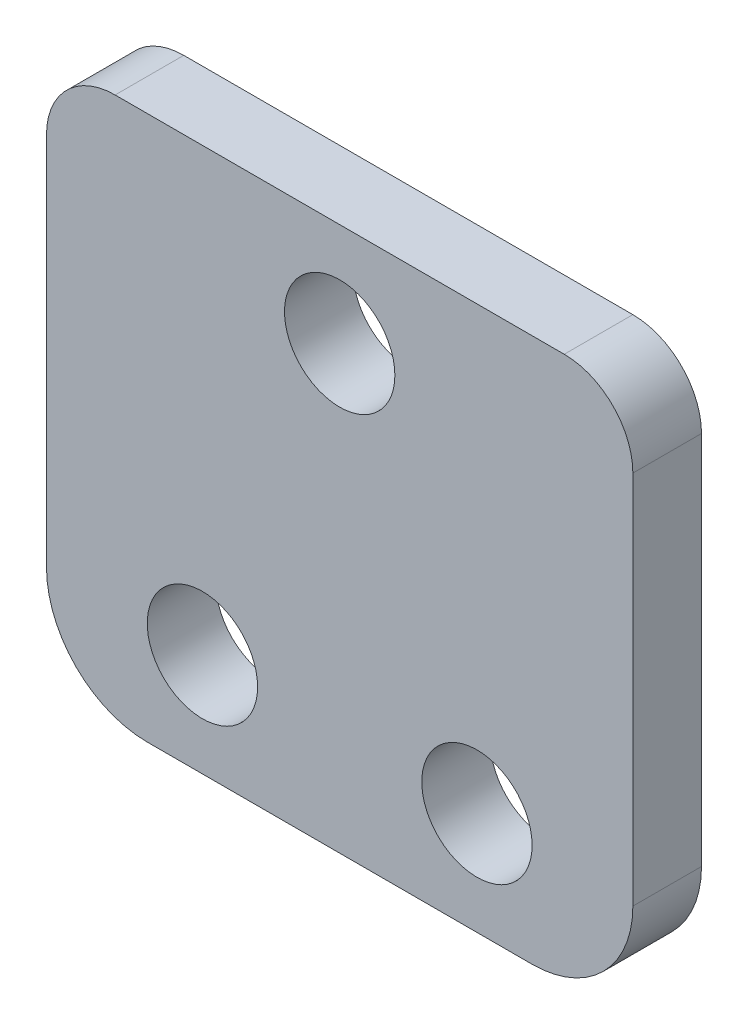
ISO-10303-21;
HEADER;
FILE_DESCRIPTION(('STEP AP214'),'2;1');
FILE_NAME('part.step','',(''),(''),'','','');
FILE_SCHEMA(('AUTOMOTIVE_DESIGN { 1 0 10303 214 1 1 1 1 }'));
ENDSEC;
DATA;
#1=APPLICATION_CONTEXT('core data for automotive mechanical design processes');
#2=APPLICATION_PROTOCOL_DEFINITION('international standard','automotive_design',2000,#1);
#3=PRODUCT_CONTEXT('',#1,'mechanical');
#4=PRODUCT('Part','Part','',(#3));
#5=PRODUCT_RELATED_PRODUCT_CATEGORY('part','',(#4));
#6=PRODUCT_DEFINITION_FORMATION('','',#4);
#7=PRODUCT_DEFINITION_CONTEXT('part definition',#1,'design');
#8=PRODUCT_DEFINITION('design','',#6,#7);
#9=PRODUCT_DEFINITION_SHAPE('','',#8);
#10=(LENGTH_UNIT() NAMED_UNIT(*) SI_UNIT(.MILLI.,.METRE.));
#11=(NAMED_UNIT(*) PLANE_ANGLE_UNIT() SI_UNIT($,.RADIAN.));
#12=(NAMED_UNIT(*) SI_UNIT($,.STERADIAN.) SOLID_ANGLE_UNIT());
#13=UNCERTAINTY_MEASURE_WITH_UNIT(LENGTH_MEASURE(1.E-05),#10,'distance_accuracy_value','');
#14=(GEOMETRIC_REPRESENTATION_CONTEXT(3) GLOBAL_UNCERTAINTY_ASSIGNED_CONTEXT((#13)) GLOBAL_UNIT_ASSIGNED_CONTEXT((#10,
#11,#12)) REPRESENTATION_CONTEXT('',''));
#15=CARTESIAN_POINT('',(0.,0.,0.));
#16=DIRECTION('',(0.,0.,1.));
#17=DIRECTION('',(1.,0.,0.));
#18=AXIS2_PLACEMENT_3D('',#15,#16,#17);
#19=CARTESIAN_POINT('',(-13.5636000000001,0.,3.175));
#20=DIRECTION('',(-1.,0.,0.));
#21=DIRECTION('',(0.,-1.,0.));
#22=AXIS2_PLACEMENT_3D('',#19,#20,#21);
#23=PLANE('',#22);
#24=DIRECTION('',(0.,1.,0.));
#25=VECTOR('',#24,1.);
#26=CARTESIAN_POINT('',(-13.5636000000001,0.,0.));
#27=LINE('',#26,#25);
#28=CARTESIAN_POINT('',(-13.5636000000001,0.,0.));
#29=VERTEX_POINT('',#28);
#30=CARTESIAN_POINT('',(-13.5636000000001,17.3481999999997,0.));
#31=VERTEX_POINT('',#30);
#32=EDGE_CURVE('E128',#29,#31,#27,.T.);
#33=ORIENTED_EDGE('',*,*,#32,.F.);
#34=DIRECTION('',(0.,0.,-1.));
#35=VECTOR('',#34,1.);
#36=CARTESIAN_POINT('',(-13.5636000000001,0.,3.175));
#37=LINE('',#36,#35);
#38=CARTESIAN_POINT('',(-13.5636000000001,0.,3.175));
#39=VERTEX_POINT('',#38);
#40=EDGE_CURVE('E11',#39,#29,#37,.T.);
#41=ORIENTED_EDGE('',*,*,#40,.F.);
#42=DIRECTION('',(0.,1.,0.));
#43=VECTOR('',#42,1.);
#44=CARTESIAN_POINT('',(-13.5636000000001,0.,3.175));
#45=LINE('',#44,#43);
#46=CARTESIAN_POINT('',(-13.5636000000001,17.3481999999997,3.175));
#47=VERTEX_POINT('',#46);
#48=EDGE_CURVE('E146',#39,#47,#45,.T.);
#49=ORIENTED_EDGE('',*,*,#48,.T.);
#50=DIRECTION('',(0.,0.,-1.));
#51=VECTOR('',#50,1.);
#52=CARTESIAN_POINT('',(-13.5636000000001,17.3481999999997,3.175));
#53=LINE('',#52,#51);
#54=EDGE_CURVE('E86',#47,#31,#53,.T.);
#55=ORIENTED_EDGE('',*,*,#54,.T.);
#56=EDGE_LOOP('',(#33,#41,#49,#55));
#57=FACE_BOUND('',#56,.T.);
#58=ADVANCED_FACE('F35',(#57),#23,.T.);
#59=CARTESIAN_POINT('',(-8.90270000000005,0.,3.175));
#60=DIRECTION('',(0.,0.,-1.));
#61=DIRECTION('',(-1.,0.,0.));
#62=AXIS2_PLACEMENT_3D('',#59,#60,#61);
#63=CYLINDRICAL_SURFACE('',#62,4.6609);
#64=CARTESIAN_POINT('',(-8.90270000000005,0.,0.));
#65=DIRECTION('',(0.,0.,1.));
#66=DIRECTION('',(1.,0.,0.));
#67=AXIS2_PLACEMENT_3D('',#64,#65,#66);
#68=CIRCLE('',#67,4.6609);
#69=CARTESIAN_POINT('',(-8.90270000000005,-4.6609,0.));
#70=VERTEX_POINT('',#69);
#71=EDGE_CURVE('E131',#29,#70,#68,.T.);
#72=ORIENTED_EDGE('',*,*,#71,.T.);
#73=DIRECTION('',(0.,0.,-1.));
#74=VECTOR('',#73,1.);
#75=CARTESIAN_POINT('',(-8.90270000000005,-4.6609,3.175));
#76=LINE('',#75,#74);
#77=CARTESIAN_POINT('',(-8.90270000000005,-4.6609,3.175));
#78=VERTEX_POINT('',#77);
#79=EDGE_CURVE('E43',#78,#70,#76,.T.);
#80=ORIENTED_EDGE('',*,*,#79,.F.);
#81=CARTESIAN_POINT('',(-8.90270000000005,0.,3.175));
#82=DIRECTION('',(0.,0.,1.));
#83=DIRECTION('',(1.,0.,0.));
#84=AXIS2_PLACEMENT_3D('',#81,#82,#83);
#85=CIRCLE('',#84,4.6609);
#86=EDGE_CURVE('E178',#39,#78,#85,.T.);
#87=ORIENTED_EDGE('',*,*,#86,.F.);
#88=ORIENTED_EDGE('',*,*,#40,.T.);
#89=EDGE_LOOP('',(#72,#80,#87,#88));
#90=FACE_BOUND('',#89,.T.);
#91=ADVANCED_FACE('F163',(#90),#63,.T.);
#92=CARTESIAN_POINT('',(0.,-4.6609,3.175));
#93=DIRECTION('',(0.,-1.,0.));
#94=DIRECTION('',(1.,0.,0.));
#95=AXIS2_PLACEMENT_3D('',#92,#93,#94);
#96=PLANE('',#95);
#97=DIRECTION('',(-1.,0.,0.));
#98=VECTOR('',#97,1.);
#99=CARTESIAN_POINT('',(0.,-4.6609,0.));
#100=LINE('',#99,#98);
#101=CARTESIAN_POINT('',(8.9027,-4.6609,0.));
#102=VERTEX_POINT('',#101);
#103=EDGE_CURVE('E135',#102,#70,#100,.T.);
#104=ORIENTED_EDGE('',*,*,#103,.F.);
#105=DIRECTION('',(0.,0.,-1.));
#106=VECTOR('',#105,1.);
#107=CARTESIAN_POINT('',(8.9027,-4.6609,3.175));
#108=LINE('',#107,#106);
#109=CARTESIAN_POINT('',(8.9027,-4.6609,3.175));
#110=VERTEX_POINT('',#109);
#111=EDGE_CURVE('E153',#110,#102,#108,.T.);
#112=ORIENTED_EDGE('',*,*,#111,.F.);
#113=DIRECTION('',(-1.,0.,0.));
#114=VECTOR('',#113,1.);
#115=CARTESIAN_POINT('',(0.,-4.6609,3.175));
#116=LINE('',#115,#114);
#117=EDGE_CURVE('E160',#110,#78,#116,.T.);
#118=ORIENTED_EDGE('',*,*,#117,.T.);
#119=ORIENTED_EDGE('',*,*,#79,.T.);
#120=EDGE_LOOP('',(#104,#112,#118,#119));
#121=FACE_BOUND('',#120,.T.);
#122=ADVANCED_FACE('F158',(#121),#96,.T.);
#123=CARTESIAN_POINT('',(8.9027,0.,3.175));
#124=DIRECTION('',(0.,0.,-1.));
#125=DIRECTION('',(-1.,0.,0.));
#126=AXIS2_PLACEMENT_3D('',#123,#124,#125);
#127=CYLINDRICAL_SURFACE('',#126,4.6609);
#128=CARTESIAN_POINT('',(8.9027,0.,0.));
#129=DIRECTION('',(0.,0.,1.));
#130=DIRECTION('',(1.,0.,0.));
#131=AXIS2_PLACEMENT_3D('',#128,#129,#130);
#132=CIRCLE('',#131,4.6609);
#133=CARTESIAN_POINT('',(13.5636,0.,0.));
#134=VERTEX_POINT('',#133);
#135=EDGE_CURVE('E138',#102,#134,#132,.T.);
#136=ORIENTED_EDGE('',*,*,#135,.T.);
#137=DIRECTION('',(0.,0.,-1.));
#138=VECTOR('',#137,1.);
#139=CARTESIAN_POINT('',(13.5636,0.,3.175));
#140=LINE('',#139,#138);
#141=CARTESIAN_POINT('',(13.5636,0.,3.175));
#142=VERTEX_POINT('',#141);
#143=EDGE_CURVE('E150',#142,#134,#140,.T.);
#144=ORIENTED_EDGE('',*,*,#143,.F.);
#145=CARTESIAN_POINT('',(8.9027,0.,3.175));
#146=DIRECTION('',(0.,0.,1.));
#147=DIRECTION('',(1.,0.,0.));
#148=AXIS2_PLACEMENT_3D('',#145,#146,#147);
#149=CIRCLE('',#148,4.6609);
#150=EDGE_CURVE('E174',#110,#142,#149,.T.);
#151=ORIENTED_EDGE('',*,*,#150,.F.);
#152=ORIENTED_EDGE('',*,*,#111,.T.);
#153=EDGE_LOOP('',(#136,#144,#151,#152));
#154=FACE_BOUND('',#153,.T.);
#155=ADVANCED_FACE('F170',(#154),#127,.T.);
#156=CARTESIAN_POINT('',(13.5636,0.,3.175));
#157=DIRECTION('',(-1.,0.,0.));
#158=DIRECTION('',(0.,0.,1.));
#159=AXIS2_PLACEMENT_3D('',#156,#157,#158);
#160=PLANE('',#159);
#161=DIRECTION('',(0.,1.,0.));
#162=VECTOR('',#161,1.);
#163=CARTESIAN_POINT('',(13.5636,0.,0.));
#164=LINE('',#163,#162);
#165=CARTESIAN_POINT('',(13.5636,17.3481999999997,0.));
#166=VERTEX_POINT('',#165);
#167=EDGE_CURVE('E140',#134,#166,#164,.T.);
#168=ORIENTED_EDGE('',*,*,#167,.T.);
#169=DIRECTION('',(0.,0.,-1.));
#170=VECTOR('',#169,1.);
#171=CARTESIAN_POINT('',(13.5636,17.3481999999997,3.175));
#172=LINE('',#171,#170);
#173=CARTESIAN_POINT('',(13.5636,17.3481999999997,3.175));
#174=VERTEX_POINT('',#173);
#175=EDGE_CURVE('E120',#174,#166,#172,.T.);
#176=ORIENTED_EDGE('',*,*,#175,.F.);
#177=DIRECTION('',(0.,1.,0.));
#178=VECTOR('',#177,1.);
#179=CARTESIAN_POINT('',(13.5636,0.,3.175));
#180=LINE('',#179,#178);
#181=EDGE_CURVE('E111',#142,#174,#180,.T.);
#182=ORIENTED_EDGE('',*,*,#181,.F.);
#183=ORIENTED_EDGE('',*,*,#143,.T.);
#184=EDGE_LOOP('',(#168,#176,#182,#183));
#185=FACE_BOUND('',#184,.T.);
#186=ADVANCED_FACE('F173',(#185),#160,.F.);
#187=CARTESIAN_POINT('',(10.3886,17.3481999999997,3.175));
#188=DIRECTION('',(0.,0.,-1.));
#189=DIRECTION('',(-1.,0.,0.));
#190=AXIS2_PLACEMENT_3D('',#187,#188,#189);
#191=CYLINDRICAL_SURFACE('',#190,3.175);
#192=CARTESIAN_POINT('',(10.3886,17.3481999999997,0.));
#193=DIRECTION('',(0.,0.,1.));
#194=DIRECTION('',(1.,0.,0.));
#195=AXIS2_PLACEMENT_3D('',#192,#193,#194);
#196=CIRCLE('',#195,3.175);
#197=CARTESIAN_POINT('',(10.3886,20.5231999999997,0.));
#198=VERTEX_POINT('',#197);
#199=EDGE_CURVE('E119',#166,#198,#196,.T.);
#200=ORIENTED_EDGE('',*,*,#199,.T.);
#201=DIRECTION('',(0.,0.,-1.));
#202=VECTOR('',#201,1.);
#203=CARTESIAN_POINT('',(10.3886,20.5231999999997,3.175));
#204=LINE('',#203,#202);
#205=CARTESIAN_POINT('',(10.3886,20.5231999999997,3.175));
#206=VERTEX_POINT('',#205);
#207=EDGE_CURVE('E116',#206,#198,#204,.T.);
#208=ORIENTED_EDGE('',*,*,#207,.F.);
#209=CARTESIAN_POINT('',(10.3886,17.3481999999997,3.175));
#210=DIRECTION('',(0.,0.,1.));
#211=DIRECTION('',(1.,0.,0.));
#212=AXIS2_PLACEMENT_3D('',#209,#210,#211);
#213=CIRCLE('',#212,3.175);
#214=EDGE_CURVE('E105',#174,#206,#213,.T.);
#215=ORIENTED_EDGE('',*,*,#214,.F.);
#216=ORIENTED_EDGE('',*,*,#175,.T.);
#217=EDGE_LOOP('',(#200,#208,#215,#216));
#218=FACE_BOUND('',#217,.T.);
#219=ADVANCED_FACE('F117',(#218),#191,.T.);
#220=CARTESIAN_POINT('',(0.,20.5231999999997,3.175));
#221=DIRECTION('',(0.,-1.,0.));
#222=DIRECTION('',(1.,0.,0.));
#223=AXIS2_PLACEMENT_3D('',#220,#221,#222);
#224=PLANE('',#223);
#225=DIRECTION('',(-1.,0.,0.));
#226=VECTOR('',#225,1.);
#227=CARTESIAN_POINT('',(0.,20.5231999999997,0.));
#228=LINE('',#227,#226);
#229=CARTESIAN_POINT('',(-10.3886000000001,20.5231999999997,0.));
#230=VERTEX_POINT('',#229);
#231=EDGE_CURVE('E79',#198,#230,#228,.T.);
#232=ORIENTED_EDGE('',*,*,#231,.T.);
#233=DIRECTION('',(0.,0.,-1.));
#234=VECTOR('',#233,1.);
#235=CARTESIAN_POINT('',(-10.3886000000001,20.5231999999997,3.175));
#236=LINE('',#235,#234);
#237=CARTESIAN_POINT('',(-10.3886000000001,20.5231999999997,3.175));
#238=VERTEX_POINT('',#237);
#239=EDGE_CURVE('E121',#238,#230,#236,.T.);
#240=ORIENTED_EDGE('',*,*,#239,.F.);
#241=DIRECTION('',(-1.,0.,0.));
#242=VECTOR('',#241,1.);
#243=CARTESIAN_POINT('',(0.,20.5231999999997,3.175));
#244=LINE('',#243,#242);
#245=EDGE_CURVE('E109',#206,#238,#244,.T.);
#246=ORIENTED_EDGE('',*,*,#245,.F.);
#247=ORIENTED_EDGE('',*,*,#207,.T.);
#248=EDGE_LOOP('',(#232,#240,#246,#247));
#249=FACE_BOUND('',#248,.T.);
#250=ADVANCED_FACE('F123',(#249),#224,.F.);
#251=CARTESIAN_POINT('',(-10.3886000000001,17.3481999999997,3.175));
#252=DIRECTION('',(0.,0.,-1.));
#253=DIRECTION('',(-1.,0.,0.));
#254=AXIS2_PLACEMENT_3D('',#251,#252,#253);
#255=CYLINDRICAL_SURFACE('',#254,3.175);
#256=CARTESIAN_POINT('',(-10.3886000000001,17.3481999999997,0.));
#257=DIRECTION('',(0.,0.,1.));
#258=DIRECTION('',(1.,0.,0.));
#259=AXIS2_PLACEMENT_3D('',#256,#257,#258);
#260=CIRCLE('',#259,3.175);
#261=EDGE_CURVE('E144',#230,#31,#260,.T.);
#262=ORIENTED_EDGE('',*,*,#261,.T.);
#263=ORIENTED_EDGE('',*,*,#54,.F.);
#264=CARTESIAN_POINT('',(-10.3886000000001,17.3481999999997,3.175));
#265=DIRECTION('',(0.,0.,1.));
#266=DIRECTION('',(1.,0.,0.));
#267=AXIS2_PLACEMENT_3D('',#264,#265,#266);
#268=CIRCLE('',#267,3.175);
#269=EDGE_CURVE('E51',#238,#47,#268,.T.);
#270=ORIENTED_EDGE('',*,*,#269,.F.);
#271=ORIENTED_EDGE('',*,*,#239,.T.);
#272=EDGE_LOOP('',(#262,#263,#270,#271));
#273=FACE_BOUND('',#272,.T.);
#274=ADVANCED_FACE('F203',(#273),#255,.T.);
#275=CARTESIAN_POINT('',(0.,0.,3.175));
#276=DIRECTION('',(0.,0.,1.));
#277=DIRECTION('',(1.,0.,0.));
#278=AXIS2_PLACEMENT_3D('',#275,#276,#277);
#279=PLANE('',#278);
#280=CARTESIAN_POINT('',(6.35,0.101600000000004,3.175));
#281=DIRECTION('',(0.,0.,1.));
#282=DIRECTION('',(1.,0.,0.));
#283=AXIS2_PLACEMENT_3D('',#280,#281,#282);
#284=CIRCLE('',#283,2.55269999999999);
#285=CARTESIAN_POINT('',(8.90269999999999,0.101600000000004,3.175));
#286=VERTEX_POINT('',#285);
#287=EDGE_CURVE('E195',#286,#286,#284,.T.);
#288=ORIENTED_EDGE('',*,*,#287,.F.);
#289=EDGE_LOOP('',(#288));
#290=FACE_BOUND('',#289,.T.);
#291=CARTESIAN_POINT('',(-6.35,0.101600000000004,3.175));
#292=DIRECTION('',(0.,0.,1.));
#293=DIRECTION('',(1.,0.,0.));
#294=AXIS2_PLACEMENT_3D('',#291,#292,#293);
#295=CIRCLE('',#294,2.55269999999999);
#296=CARTESIAN_POINT('',(-3.79730000000001,0.101600000000004,3.175));
#297=VERTEX_POINT('',#296);
#298=EDGE_CURVE('E189',#297,#297,#295,.T.);
#299=ORIENTED_EDGE('',*,*,#298,.F.);
#300=EDGE_LOOP('',(#299));
#301=FACE_BOUND('',#300,.T.);
#302=CARTESIAN_POINT('',(0.,15.7606999999997,3.175));
#303=DIRECTION('',(0.,0.,1.));
#304=DIRECTION('',(1.,0.,0.));
#305=AXIS2_PLACEMENT_3D('',#302,#303,#304);
#306=CIRCLE('',#305,2.55269999999999);
#307=CARTESIAN_POINT('',(2.55269999999999,15.7606999999997,3.175));
#308=VERTEX_POINT('',#307);
#309=EDGE_CURVE('E183',#308,#308,#306,.T.);
#310=ORIENTED_EDGE('',*,*,#309,.F.);
#311=EDGE_LOOP('',(#310));
#312=FACE_BOUND('',#311,.T.);
#313=ORIENTED_EDGE('',*,*,#48,.F.);
#314=ORIENTED_EDGE('',*,*,#86,.T.);
#315=ORIENTED_EDGE('',*,*,#117,.F.);
#316=ORIENTED_EDGE('',*,*,#150,.T.);
#317=ORIENTED_EDGE('',*,*,#181,.T.);
#318=ORIENTED_EDGE('',*,*,#214,.T.);
#319=ORIENTED_EDGE('',*,*,#245,.T.);
#320=ORIENTED_EDGE('',*,*,#269,.T.);
#321=EDGE_LOOP('',(#313,#314,#315,#316,#317,#318,#319,#320));
#322=FACE_BOUND('',#321,.T.);
#323=ADVANCED_FACE('F107',(#290,#301,#312,#322),#279,.T.);
#324=CARTESIAN_POINT('',(0.,0.,0.));
#325=DIRECTION('',(0.,0.,1.));
#326=DIRECTION('',(1.,0.,0.));
#327=AXIS2_PLACEMENT_3D('',#324,#325,#326);
#328=PLANE('',#327);
#329=CARTESIAN_POINT('',(6.35,0.101600000000004,0.));
#330=DIRECTION('',(0.,0.,1.));
#331=DIRECTION('',(1.,0.,0.));
#332=AXIS2_PLACEMENT_3D('',#329,#330,#331);
#333=CIRCLE('',#332,2.5527);
#334=CARTESIAN_POINT('',(8.9027,0.101600000000004,0.));
#335=VERTEX_POINT('',#334);
#336=EDGE_CURVE('E192',#335,#335,#333,.T.);
#337=ORIENTED_EDGE('',*,*,#336,.T.);
#338=EDGE_LOOP('',(#337));
#339=FACE_BOUND('',#338,.T.);
#340=CARTESIAN_POINT('',(-6.35,0.101600000000004,0.));
#341=DIRECTION('',(0.,0.,1.));
#342=DIRECTION('',(1.,0.,0.));
#343=AXIS2_PLACEMENT_3D('',#340,#341,#342);
#344=CIRCLE('',#343,2.5527);
#345=CARTESIAN_POINT('',(-3.7973,0.101600000000004,0.));
#346=VERTEX_POINT('',#345);
#347=EDGE_CURVE('E186',#346,#346,#344,.T.);
#348=ORIENTED_EDGE('',*,*,#347,.T.);
#349=EDGE_LOOP('',(#348));
#350=FACE_BOUND('',#349,.T.);
#351=CARTESIAN_POINT('',(0.,15.7606999999997,0.));
#352=DIRECTION('',(0.,0.,1.));
#353=DIRECTION('',(1.,0.,0.));
#354=AXIS2_PLACEMENT_3D('',#351,#352,#353);
#355=CIRCLE('',#354,2.5527);
#356=CARTESIAN_POINT('',(2.5527,15.7606999999997,0.));
#357=VERTEX_POINT('',#356);
#358=EDGE_CURVE('E132',#357,#357,#355,.T.);
#359=ORIENTED_EDGE('',*,*,#358,.T.);
#360=EDGE_LOOP('',(#359));
#361=FACE_BOUND('',#360,.T.);
#362=ORIENTED_EDGE('',*,*,#32,.T.);
#363=ORIENTED_EDGE('',*,*,#261,.F.);
#364=ORIENTED_EDGE('',*,*,#231,.F.);
#365=ORIENTED_EDGE('',*,*,#199,.F.);
#366=ORIENTED_EDGE('',*,*,#167,.F.);
#367=ORIENTED_EDGE('',*,*,#135,.F.);
#368=ORIENTED_EDGE('',*,*,#103,.T.);
#369=ORIENTED_EDGE('',*,*,#71,.F.);
#370=EDGE_LOOP('',(#362,#363,#364,#365,#366,#367,#368,#369));
#371=FACE_BOUND('',#370,.T.);
#372=ADVANCED_FACE('F166',(#339,#350,#361,#371),#328,.F.);
#373=CARTESIAN_POINT('',(0.,15.7606999999997,3.175));
#374=DIRECTION('',(0.,0.,1.));
#375=DIRECTION('',(1.,0.,0.));
#376=AXIS2_PLACEMENT_3D('',#373,#374,#375);
#377=CYLINDRICAL_SURFACE('',#376,2.55269999999999);
#378=ORIENTED_EDGE('',*,*,#358,.F.);
#379=EDGE_LOOP('',(#378));
#380=FACE_BOUND('',#379,.T.);
#381=ORIENTED_EDGE('',*,*,#309,.T.);
#382=EDGE_LOOP('',(#381));
#383=FACE_BOUND('',#382,.T.);
#384=ADVANCED_FACE('F209',(#380,#383),#377,.F.);
#385=CARTESIAN_POINT('',(-6.35,0.101600000000004,3.175));
#386=DIRECTION('',(0.,0.,1.));
#387=DIRECTION('',(1.,0.,0.));
#388=AXIS2_PLACEMENT_3D('',#385,#386,#387);
#389=CYLINDRICAL_SURFACE('',#388,2.55269999999999);
#390=ORIENTED_EDGE('',*,*,#347,.F.);
#391=EDGE_LOOP('',(#390));
#392=FACE_BOUND('',#391,.T.);
#393=ORIENTED_EDGE('',*,*,#298,.T.);
#394=EDGE_LOOP('',(#393));
#395=FACE_BOUND('',#394,.T.);
#396=ADVANCED_FACE('F211',(#392,#395),#389,.F.);
#397=CARTESIAN_POINT('',(6.35,0.101600000000004,3.175));
#398=DIRECTION('',(0.,0.,1.));
#399=DIRECTION('',(1.,0.,0.));
#400=AXIS2_PLACEMENT_3D('',#397,#398,#399);
#401=CYLINDRICAL_SURFACE('',#400,2.55269999999999);
#402=ORIENTED_EDGE('',*,*,#336,.F.);
#403=EDGE_LOOP('',(#402));
#404=FACE_BOUND('',#403,.T.);
#405=ORIENTED_EDGE('',*,*,#287,.T.);
#406=EDGE_LOOP('',(#405));
#407=FACE_BOUND('',#406,.T.);
#408=ADVANCED_FACE('F199',(#404,#407),#401,.F.);
#409=CLOSED_SHELL('',(#58,#91,#122,#155,#186,#219,#250,#274,#323,#372,#384,#396,#408));
#410=MANIFOLD_SOLID_BREP('B2',#409);
#411=ADVANCED_BREP_SHAPE_REPRESENTATION('',(#18,#410),#14);
#412=SHAPE_DEFINITION_REPRESENTATION(#9,#411);
ENDSEC;
END-ISO-10303-21;
